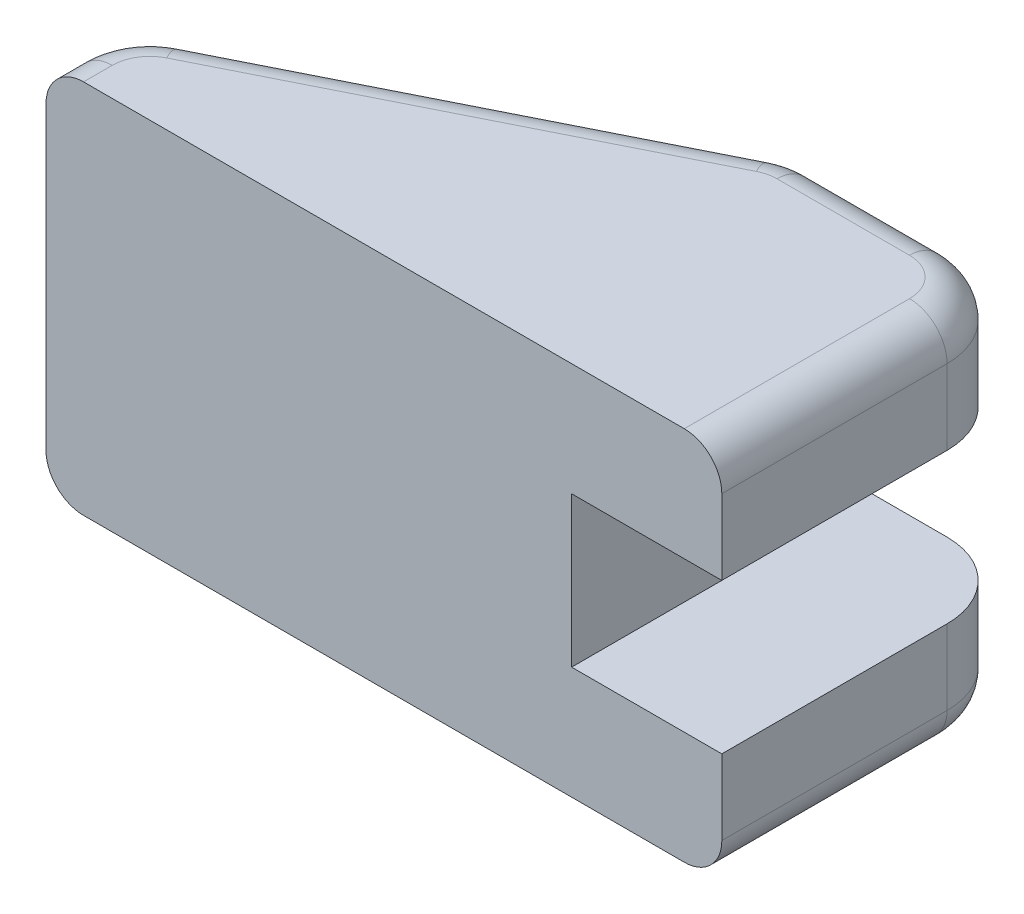
ISO-10303-21;
HEADER;
FILE_DESCRIPTION(('STEP AP214'),'2;1');
FILE_NAME('part.step','',(''),(''),'','','');
FILE_SCHEMA(('AUTOMOTIVE_DESIGN { 1 0 10303 214 1 1 1 1 }'));
ENDSEC;
DATA;
#1=APPLICATION_CONTEXT('core data for automotive mechanical design processes');
#2=APPLICATION_PROTOCOL_DEFINITION('international standard','automotive_design',2000,#1);
#3=PRODUCT_CONTEXT('',#1,'mechanical');
#4=PRODUCT('Part','Part','',(#3));
#5=PRODUCT_RELATED_PRODUCT_CATEGORY('part','',(#4));
#6=PRODUCT_DEFINITION_FORMATION('','',#4);
#7=PRODUCT_DEFINITION_CONTEXT('part definition',#1,'design');
#8=PRODUCT_DEFINITION('design','',#6,#7);
#9=PRODUCT_DEFINITION_SHAPE('','',#8);
#10=(LENGTH_UNIT() NAMED_UNIT(*) SI_UNIT(.MILLI.,.METRE.));
#11=(NAMED_UNIT(*) PLANE_ANGLE_UNIT() SI_UNIT($,.RADIAN.));
#12=(NAMED_UNIT(*) SI_UNIT($,.STERADIAN.) SOLID_ANGLE_UNIT());
#13=UNCERTAINTY_MEASURE_WITH_UNIT(LENGTH_MEASURE(1.E-05),#10,'distance_accuracy_value','');
#14=(GEOMETRIC_REPRESENTATION_CONTEXT(3) GLOBAL_UNCERTAINTY_ASSIGNED_CONTEXT((#13)) GLOBAL_UNIT_ASSIGNED_CONTEXT((#10,
#11,#12)) REPRESENTATION_CONTEXT('',''));
#15=CARTESIAN_POINT('',(0.,0.,0.));
#16=DIRECTION('',(0.,0.,1.));
#17=DIRECTION('',(1.,0.,0.));
#18=AXIS2_PLACEMENT_3D('',#15,#16,#17);
#19=CARTESIAN_POINT('',(-652.,0.,-40.));
#20=DIRECTION('',(-1.,0.,0.));
#21=DIRECTION('',(0.,0.,1.));
#22=AXIS2_PLACEMENT_3D('',#19,#20,#21);
#23=PLANE('',#22);
#24=DIRECTION('',(0.,-1.,0.));
#25=VECTOR('',#24,1.);
#26=CARTESIAN_POINT('',(-652.,0.,-3.81966011250102));
#27=LINE('',#26,#25);
#28=CARTESIAN_POINT('',(-652.,420.,-3.81966011250102));
#29=VERTEX_POINT('',#28);
#30=CARTESIAN_POINT('',(-652.,380.,-3.81966011250102));
#31=VERTEX_POINT('',#30);
#32=EDGE_CURVE('E253',#29,#31,#27,.T.);
#33=ORIENTED_EDGE('',*,*,#32,.T.);
#34=DIRECTION('',(0.,0.,1.));
#35=VECTOR('',#34,1.);
#36=CARTESIAN_POINT('',(-652.,380.,0.));
#37=LINE('',#36,#35);
#38=CARTESIAN_POINT('',(-652.,380.,0.));
#39=VERTEX_POINT('',#38);
#40=EDGE_CURVE('E269',#31,#39,#37,.T.);
#41=ORIENTED_EDGE('',*,*,#40,.T.);
#42=DIRECTION('',(0.,-1.,0.));
#43=VECTOR('',#42,1.);
#44=CARTESIAN_POINT('',(-652.,0.,0.));
#45=LINE('',#44,#43);
#46=CARTESIAN_POINT('',(-652.,420.,0.));
#47=VERTEX_POINT('',#46);
#48=EDGE_CURVE('E218',#47,#39,#45,.T.);
#49=ORIENTED_EDGE('',*,*,#48,.F.);
#50=DIRECTION('',(0.,0.,1.));
#51=VECTOR('',#50,1.);
#52=CARTESIAN_POINT('',(-652.,420.,-40.));
#53=LINE('',#52,#51);
#54=EDGE_CURVE('E267',#47,#29,#53,.F.);
#55=ORIENTED_EDGE('',*,*,#54,.T.);
#56=EDGE_LOOP('',(#33,#41,#49,#55));
#57=FACE_BOUND('',#56,.T.);
#58=ADVANCED_FACE('F44',(#57),#23,.T.);
#59=CARTESIAN_POINT('',(0.,425.,-40.));
#60=DIRECTION('',(0.,1.,0.));
#61=DIRECTION('',(0.,0.,1.));
#62=AXIS2_PLACEMENT_3D('',#59,#60,#61);
#63=PLANE('',#62);
#64=DIRECTION('',(-1.,0.,0.));
#65=VECTOR('',#64,1.);
#66=CARTESIAN_POINT('',(0.,425.,0.));
#67=LINE('',#66,#65);
#68=CARTESIAN_POINT('',(-567.,425.,0.));
#69=VERTEX_POINT('',#68);
#70=CARTESIAN_POINT('',(-647.,425.,0.));
#71=VERTEX_POINT('',#70);
#72=EDGE_CURVE('E209',#69,#71,#67,.T.);
#73=ORIENTED_EDGE('',*,*,#72,.F.);
#74=DIRECTION('',(0.,0.,1.));
#75=VECTOR('',#74,1.);
#76=CARTESIAN_POINT('',(-567.,425.,-40.));
#77=LINE('',#76,#75);
#78=CARTESIAN_POINT('',(-567.,425.,-30.));
#79=VERTEX_POINT('',#78);
#80=EDGE_CURVE('E61',#69,#79,#77,.F.);
#81=ORIENTED_EDGE('',*,*,#80,.T.);
#82=CARTESIAN_POINT('',(-572.,425.,-30.));
#83=DIRECTION('',(0.,1.,0.));
#84=DIRECTION('',(0.,0.,1.));
#85=AXIS2_PLACEMENT_3D('',#82,#83,#84);
#86=CIRCLE('',#85,5.);
#87=CARTESIAN_POINT('',(-572.,425.,-35.));
#88=VERTEX_POINT('',#87);
#89=EDGE_CURVE('E65',#79,#88,#86,.T.);
#90=ORIENTED_EDGE('',*,*,#89,.T.);
#91=DIRECTION('',(-1.,0.,0.));
#92=VECTOR('',#91,1.);
#93=CARTESIAN_POINT('',(-589.639320225002,425.,-35.));
#94=LINE('',#93,#92);
#95=CARTESIAN_POINT('',(-589.639320225002,425.,-35.));
#96=VERTEX_POINT('',#95);
#97=EDGE_CURVE('E321',#88,#96,#94,.T.);
#98=ORIENTED_EDGE('',*,*,#97,.T.);
#99=CARTESIAN_POINT('',(-589.639320225002,425.,-30.));
#100=DIRECTION('',(0.,1.,0.));
#101=DIRECTION('',(0.,0.,1.));
#102=AXIS2_PLACEMENT_3D('',#99,#100,#101);
#103=CIRCLE('',#102,5.);
#104=CARTESIAN_POINT('',(-591.875388202502,425.,-34.4721359549996));
#105=VERTEX_POINT('',#104);
#106=EDGE_CURVE('E319',#96,#105,#103,.T.);
#107=ORIENTED_EDGE('',*,*,#106,.T.);
#108=DIRECTION('',(-0.894427190999917,0.,0.447213595499956));
#109=VECTOR('',#108,1.);
#110=CARTESIAN_POINT('',(-116.163932022499,425.,-272.327864045));
#111=LINE('',#110,#109);
#112=CARTESIAN_POINT('',(-644.2360679775,425.,-8.29179606750059));
#113=VERTEX_POINT('',#112);
#114=EDGE_CURVE('E313',#105,#113,#111,.T.);
#115=ORIENTED_EDGE('',*,*,#114,.T.);
#116=CARTESIAN_POINT('',(-642.,425.,-3.81966011250102));
#117=DIRECTION('',(0.,1.,0.));
#118=DIRECTION('',(0.,0.,1.));
#119=AXIS2_PLACEMENT_3D('',#116,#117,#118);
#120=CIRCLE('',#119,5.);
#121=CARTESIAN_POINT('',(-647.,425.,-3.81966011250102));
#122=VERTEX_POINT('',#121);
#123=EDGE_CURVE('E315',#113,#122,#120,.T.);
#124=ORIENTED_EDGE('',*,*,#123,.T.);
#125=DIRECTION('',(0.,0.,1.));
#126=VECTOR('',#125,1.);
#127=CARTESIAN_POINT('',(-647.,425.,-40.));
#128=LINE('',#127,#126);
#129=EDGE_CURVE('E317',#122,#71,#128,.T.);
#130=ORIENTED_EDGE('',*,*,#129,.T.);
#131=EDGE_LOOP('',(#73,#81,#90,#98,#107,#115,#124,#130));
#132=FACE_BOUND('',#131,.T.);
#133=ADVANCED_FACE('F372',(#132),#63,.T.);
#134=CARTESIAN_POINT('',(-562.,0.,-40.));
#135=DIRECTION('',(1.,0.,0.));
#136=DIRECTION('',(0.,0.,-1.));
#137=AXIS2_PLACEMENT_3D('',#134,#135,#136);
#138=PLANE('',#137);
#139=DIRECTION('',(0.,1.,0.));
#140=VECTOR('',#139,1.);
#141=CARTESIAN_POINT('',(-562.,425.,-30.));
#142=LINE('',#141,#140);
#143=CARTESIAN_POINT('',(-562.,410.,-30.));
#144=VERTEX_POINT('',#143);
#145=CARTESIAN_POINT('',(-562.,420.,-30.));
#146=VERTEX_POINT('',#145);
#147=EDGE_CURVE('E262',#144,#146,#142,.T.);
#148=ORIENTED_EDGE('',*,*,#147,.T.);
#149=DIRECTION('',(0.,0.,1.));
#150=VECTOR('',#149,1.);
#151=CARTESIAN_POINT('',(-562.,420.,-40.));
#152=LINE('',#151,#150);
#153=CARTESIAN_POINT('',(-562.,420.,0.));
#154=VERTEX_POINT('',#153);
#155=EDGE_CURVE('E310',#146,#154,#152,.T.);
#156=ORIENTED_EDGE('',*,*,#155,.T.);
#157=DIRECTION('',(0.,1.,0.));
#158=VECTOR('',#157,1.);
#159=CARTESIAN_POINT('',(-562.,0.,0.));
#160=LINE('',#159,#158);
#161=CARTESIAN_POINT('',(-562.,410.,0.));
#162=VERTEX_POINT('',#161);
#163=EDGE_CURVE('E234',#162,#154,#160,.T.);
#164=ORIENTED_EDGE('',*,*,#163,.F.);
#165=DIRECTION('',(0.,0.,1.));
#166=VECTOR('',#165,1.);
#167=CARTESIAN_POINT('',(-562.,410.,-40.));
#168=LINE('',#167,#166);
#169=EDGE_CURVE('E239',#144,#162,#168,.T.);
#170=ORIENTED_EDGE('',*,*,#169,.F.);
#171=EDGE_LOOP('',(#148,#156,#164,#170));
#172=FACE_BOUND('',#171,.T.);
#173=ADVANCED_FACE('F381',(#172),#138,.T.);
#174=CARTESIAN_POINT('',(0.,410.,-40.));
#175=DIRECTION('',(0.,-1.,0.));
#176=DIRECTION('',(0.,0.,-1.));
#177=AXIS2_PLACEMENT_3D('',#174,#175,#176);
#178=PLANE('',#177);
#179=DIRECTION('',(1.,0.,0.));
#180=VECTOR('',#179,1.);
#181=CARTESIAN_POINT('',(0.,410.,-40.));
#182=LINE('',#181,#180);
#183=CARTESIAN_POINT('',(-582.,410.,-40.));
#184=VERTEX_POINT('',#183);
#185=CARTESIAN_POINT('',(-572.,410.,-40.));
#186=VERTEX_POINT('',#185);
#187=EDGE_CURVE('E214',#184,#186,#182,.T.);
#188=ORIENTED_EDGE('',*,*,#187,.T.);
#189=CARTESIAN_POINT('',(-572.,410.,-30.));
#190=DIRECTION('',(0.,-1.,0.));
#191=DIRECTION('',(0.,0.,-1.));
#192=AXIS2_PLACEMENT_3D('',#189,#190,#191);
#193=CIRCLE('',#192,10.);
#194=EDGE_CURVE('E265',#186,#144,#193,.T.);
#195=ORIENTED_EDGE('',*,*,#194,.T.);
#196=ORIENTED_EDGE('',*,*,#169,.T.);
#197=DIRECTION('',(1.,0.,0.));
#198=VECTOR('',#197,1.);
#199=CARTESIAN_POINT('',(0.,410.,0.));
#200=LINE('',#199,#198);
#201=CARTESIAN_POINT('',(-582.,410.,0.));
#202=VERTEX_POINT('',#201);
#203=EDGE_CURVE('E231',#202,#162,#200,.T.);
#204=ORIENTED_EDGE('',*,*,#203,.F.);
#205=DIRECTION('',(0.,0.,1.));
#206=VECTOR('',#205,1.);
#207=CARTESIAN_POINT('',(-582.,410.,-40.));
#208=LINE('',#207,#206);
#209=EDGE_CURVE('E197',#184,#202,#208,.T.);
#210=ORIENTED_EDGE('',*,*,#209,.F.);
#211=EDGE_LOOP('',(#188,#195,#196,#204,#210));
#212=FACE_BOUND('',#211,.T.);
#213=ADVANCED_FACE('F601',(#212),#178,.T.);
#214=CARTESIAN_POINT('',(-582.,0.,-40.));
#215=DIRECTION('',(1.,0.,0.));
#216=DIRECTION('',(0.,0.,-1.));
#217=AXIS2_PLACEMENT_3D('',#214,#215,#216);
#218=PLANE('',#217);
#219=DIRECTION('',(0.,1.,0.));
#220=VECTOR('',#219,1.);
#221=CARTESIAN_POINT('',(-582.,0.,0.));
#222=LINE('',#221,#220);
#223=CARTESIAN_POINT('',(-582.,390.,0.));
#224=VERTEX_POINT('',#223);
#225=EDGE_CURVE('E193',#224,#202,#222,.T.);
#226=ORIENTED_EDGE('',*,*,#225,.F.);
#227=DIRECTION('',(0.,0.,1.));
#228=VECTOR('',#227,1.);
#229=CARTESIAN_POINT('',(-582.,390.,-40.));
#230=LINE('',#229,#228);
#231=CARTESIAN_POINT('',(-582.,390.,-40.));
#232=VERTEX_POINT('',#231);
#233=EDGE_CURVE('E187',#232,#224,#230,.T.);
#234=ORIENTED_EDGE('',*,*,#233,.F.);
#235=DIRECTION('',(0.,1.,0.));
#236=VECTOR('',#235,1.);
#237=CARTESIAN_POINT('',(-582.,0.,-40.));
#238=LINE('',#237,#236);
#239=EDGE_CURVE('E191',#232,#184,#238,.T.);
#240=ORIENTED_EDGE('',*,*,#239,.T.);
#241=ORIENTED_EDGE('',*,*,#209,.T.);
#242=EDGE_LOOP('',(#226,#234,#240,#241));
#243=FACE_BOUND('',#242,.T.);
#244=ADVANCED_FACE('F189',(#243),#218,.T.);
#245=CARTESIAN_POINT('',(0.,390.,-40.));
#246=DIRECTION('',(0.,-1.,0.));
#247=DIRECTION('',(0.,0.,-1.));
#248=AXIS2_PLACEMENT_3D('',#245,#246,#247);
#249=PLANE('',#248);
#250=DIRECTION('',(0.,0.,1.));
#251=VECTOR('',#250,1.);
#252=CARTESIAN_POINT('',(-562.,390.,-40.));
#253=LINE('',#252,#251);
#254=CARTESIAN_POINT('',(-562.,390.,-30.));
#255=VERTEX_POINT('',#254);
#256=CARTESIAN_POINT('',(-562.,390.,0.));
#257=VERTEX_POINT('',#256);
#258=EDGE_CURVE('E198',#255,#257,#253,.T.);
#259=ORIENTED_EDGE('',*,*,#258,.F.);
#260=CARTESIAN_POINT('',(-572.,390.,-30.));
#261=DIRECTION('',(0.,-1.,0.));
#262=DIRECTION('',(0.,0.,-1.));
#263=AXIS2_PLACEMENT_3D('',#260,#261,#262);
#264=CIRCLE('',#263,10.);
#265=CARTESIAN_POINT('',(-572.,390.,-40.));
#266=VERTEX_POINT('',#265);
#267=EDGE_CURVE('E205',#255,#266,#264,.F.);
#268=ORIENTED_EDGE('',*,*,#267,.T.);
#269=DIRECTION('',(1.,0.,0.));
#270=VECTOR('',#269,1.);
#271=CARTESIAN_POINT('',(0.,390.,-40.));
#272=LINE('',#271,#270);
#273=EDGE_CURVE('E201',#232,#266,#272,.T.);
#274=ORIENTED_EDGE('',*,*,#273,.F.);
#275=ORIENTED_EDGE('',*,*,#233,.T.);
#276=DIRECTION('',(1.,0.,0.));
#277=VECTOR('',#276,1.);
#278=CARTESIAN_POINT('',(0.,390.,0.));
#279=LINE('',#278,#277);
#280=EDGE_CURVE('E228',#224,#257,#279,.T.);
#281=ORIENTED_EDGE('',*,*,#280,.T.);
#282=EDGE_LOOP('',(#259,#268,#274,#275,#281));
#283=FACE_BOUND('',#282,.T.);
#284=ADVANCED_FACE('F203',(#283),#249,.F.);
#285=CARTESIAN_POINT('',(-562.,0.,-40.));
#286=DIRECTION('',(-1.,0.,0.));
#287=DIRECTION('',(0.,0.,1.));
#288=AXIS2_PLACEMENT_3D('',#285,#286,#287);
#289=PLANE('',#288);
#290=DIRECTION('',(0.,-1.,0.));
#291=VECTOR('',#290,1.);
#292=CARTESIAN_POINT('',(-562.,0.,0.));
#293=LINE('',#292,#291);
#294=CARTESIAN_POINT('',(-562.,380.,0.));
#295=VERTEX_POINT('',#294);
#296=EDGE_CURVE('E225',#257,#295,#293,.T.);
#297=ORIENTED_EDGE('',*,*,#296,.T.);
#298=DIRECTION('',(0.,0.,1.));
#299=VECTOR('',#298,1.);
#300=CARTESIAN_POINT('',(-562.,380.,-40.));
#301=LINE('',#300,#299);
#302=CARTESIAN_POINT('',(-562.,380.,-30.));
#303=VERTEX_POINT('',#302);
#304=EDGE_CURVE('E298',#295,#303,#301,.F.);
#305=ORIENTED_EDGE('',*,*,#304,.T.);
#306=DIRECTION('',(0.,-1.,0.));
#307=VECTOR('',#306,1.);
#308=CARTESIAN_POINT('',(-562.,0.,-30.));
#309=LINE('',#308,#307);
#310=EDGE_CURVE('E250',#303,#255,#309,.F.);
#311=ORIENTED_EDGE('',*,*,#310,.T.);
#312=ORIENTED_EDGE('',*,*,#258,.T.);
#313=EDGE_LOOP('',(#297,#305,#311,#312));
#314=FACE_BOUND('',#313,.T.);
#315=ADVANCED_FACE('F586',(#314),#289,.F.);
#316=CARTESIAN_POINT('',(0.,375.,-40.));
#317=DIRECTION('',(0.,1.,0.));
#318=DIRECTION('',(0.,0.,1.));
#319=AXIS2_PLACEMENT_3D('',#316,#317,#318);
#320=PLANE('',#319);
#321=DIRECTION('',(-1.,0.,0.));
#322=VECTOR('',#321,1.);
#323=CARTESIAN_POINT('',(0.,375.,0.));
#324=LINE('',#323,#322);
#325=CARTESIAN_POINT('',(-567.,375.,0.));
#326=VERTEX_POINT('',#325);
#327=CARTESIAN_POINT('',(-647.,375.,0.));
#328=VERTEX_POINT('',#327);
#329=EDGE_CURVE('E221',#326,#328,#324,.T.);
#330=ORIENTED_EDGE('',*,*,#329,.T.);
#331=DIRECTION('',(0.,0.,1.));
#332=VECTOR('',#331,1.);
#333=CARTESIAN_POINT('',(-647.,375.,-3.81966011250102));
#334=LINE('',#333,#332);
#335=CARTESIAN_POINT('',(-647.,375.,-3.81966011250102));
#336=VERTEX_POINT('',#335);
#337=EDGE_CURVE('E292',#328,#336,#334,.F.);
#338=ORIENTED_EDGE('',*,*,#337,.T.);
#339=CARTESIAN_POINT('',(-642.,375.,-3.81966011250102));
#340=DIRECTION('',(0.,1.,0.));
#341=DIRECTION('',(0.,0.,1.));
#342=AXIS2_PLACEMENT_3D('',#339,#340,#341);
#343=CIRCLE('',#342,5.);
#344=CARTESIAN_POINT('',(-644.2360679775,375.,-8.2917960675006));
#345=VERTEX_POINT('',#344);
#346=EDGE_CURVE('E290',#336,#345,#343,.F.);
#347=ORIENTED_EDGE('',*,*,#346,.T.);
#348=DIRECTION('',(0.894427190999917,0.,-0.447213595499956));
#349=VECTOR('',#348,1.);
#350=CARTESIAN_POINT('',(-591.875388202502,375.,-34.4721359549995));
#351=LINE('',#350,#349);
#352=CARTESIAN_POINT('',(-591.875388202502,375.,-34.4721359549996));
#353=VERTEX_POINT('',#352);
#354=EDGE_CURVE('E280',#345,#353,#351,.T.);
#355=ORIENTED_EDGE('',*,*,#354,.T.);
#356=CARTESIAN_POINT('',(-589.639320225002,375.,-30.));
#357=DIRECTION('',(0.,1.,0.));
#358=DIRECTION('',(0.,0.,1.));
#359=AXIS2_PLACEMENT_3D('',#356,#357,#358);
#360=CIRCLE('',#359,5.);
#361=CARTESIAN_POINT('',(-589.639320225002,375.,-35.));
#362=VERTEX_POINT('',#361);
#363=EDGE_CURVE('E282',#353,#362,#360,.F.);
#364=ORIENTED_EDGE('',*,*,#363,.T.);
#365=DIRECTION('',(-1.,0.,0.));
#366=VECTOR('',#365,1.);
#367=CARTESIAN_POINT('',(0.,375.,-35.));
#368=LINE('',#367,#366);
#369=CARTESIAN_POINT('',(-572.,375.,-35.));
#370=VERTEX_POINT('',#369);
#371=EDGE_CURVE('E284',#362,#370,#368,.F.);
#372=ORIENTED_EDGE('',*,*,#371,.T.);
#373=CARTESIAN_POINT('',(-572.,375.,-30.));
#374=DIRECTION('',(0.,1.,0.));
#375=DIRECTION('',(0.,0.,1.));
#376=AXIS2_PLACEMENT_3D('',#373,#374,#375);
#377=CIRCLE('',#376,5.);
#378=CARTESIAN_POINT('',(-567.,375.,-30.));
#379=VERTEX_POINT('',#378);
#380=EDGE_CURVE('E286',#370,#379,#377,.F.);
#381=ORIENTED_EDGE('',*,*,#380,.T.);
#382=DIRECTION('',(0.,0.,1.));
#383=VECTOR('',#382,1.);
#384=CARTESIAN_POINT('',(-567.,375.,-40.));
#385=LINE('',#384,#383);
#386=EDGE_CURVE('E288',#379,#326,#385,.T.);
#387=ORIENTED_EDGE('',*,*,#386,.T.);
#388=EDGE_LOOP('',(#330,#338,#347,#355,#364,#372,#381,#387));
#389=FACE_BOUND('',#388,.T.);
#390=ADVANCED_FACE('F435',(#389),#320,.F.);
#391=CARTESIAN_POINT('',(0.,0.,-40.));
#392=DIRECTION('',(0.,0.,1.));
#393=DIRECTION('',(1.,0.,0.));
#394=AXIS2_PLACEMENT_3D('',#391,#392,#393);
#395=PLANE('',#394);
#396=DIRECTION('',(0.,-1.,0.));
#397=VECTOR('',#396,1.);
#398=CARTESIAN_POINT('',(-572.,0.,-40.));
#399=LINE('',#398,#397);
#400=CARTESIAN_POINT('',(-572.,380.,-40.));
#401=VERTEX_POINT('',#400);
#402=EDGE_CURVE('E248',#266,#401,#399,.T.);
#403=ORIENTED_EDGE('',*,*,#402,.T.);
#404=DIRECTION('',(-1.,0.,0.));
#405=VECTOR('',#404,1.);
#406=CARTESIAN_POINT('',(0.,380.,-40.));
#407=LINE('',#406,#405);
#408=CARTESIAN_POINT('',(-589.639320225002,380.,-40.));
#409=VERTEX_POINT('',#408);
#410=EDGE_CURVE('E304',#401,#409,#407,.T.);
#411=ORIENTED_EDGE('',*,*,#410,.T.);
#412=DIRECTION('',(0.,1.,0.));
#413=VECTOR('',#412,1.);
#414=CARTESIAN_POINT('',(-589.639320225002,425.,-40.));
#415=LINE('',#414,#413);
#416=CARTESIAN_POINT('',(-589.639320225002,420.,-40.));
#417=VERTEX_POINT('',#416);
#418=EDGE_CURVE('E245',#409,#417,#415,.T.);
#419=ORIENTED_EDGE('',*,*,#418,.T.);
#420=DIRECTION('',(-1.,0.,0.));
#421=VECTOR('',#420,1.);
#422=CARTESIAN_POINT('',(-572.,420.,-40.));
#423=LINE('',#422,#421);
#424=CARTESIAN_POINT('',(-572.,420.,-40.));
#425=VERTEX_POINT('',#424);
#426=EDGE_CURVE('E302',#417,#425,#423,.F.);
#427=ORIENTED_EDGE('',*,*,#426,.T.);
#428=DIRECTION('',(0.,1.,0.));
#429=VECTOR('',#428,1.);
#430=CARTESIAN_POINT('',(-572.,410.,-40.));
#431=LINE('',#430,#429);
#432=EDGE_CURVE('E241',#425,#186,#431,.F.);
#433=ORIENTED_EDGE('',*,*,#432,.T.);
#434=ORIENTED_EDGE('',*,*,#187,.F.);
#435=ORIENTED_EDGE('',*,*,#239,.F.);
#436=ORIENTED_EDGE('',*,*,#273,.T.);
#437=EDGE_LOOP('',(#403,#411,#419,#427,#433,#434,#435,#436));
#438=FACE_BOUND('',#437,.T.);
#439=ADVANCED_FACE('F212',(#438),#395,.F.);
#440=CARTESIAN_POINT('',(0.,0.,0.));
#441=DIRECTION('',(0.,0.,1.));
#442=DIRECTION('',(1.,0.,0.));
#443=AXIS2_PLACEMENT_3D('',#440,#441,#442);
#444=PLANE('',#443);
#445=ORIENTED_EDGE('',*,*,#48,.T.);
#446=CARTESIAN_POINT('',(-647.,380.,0.));
#447=DIRECTION('',(0.,0.,1.));
#448=DIRECTION('',(1.,0.,0.));
#449=AXIS2_PLACEMENT_3D('',#446,#447,#448);
#450=CIRCLE('',#449,5.);
#451=EDGE_CURVE('E278',#39,#328,#450,.T.);
#452=ORIENTED_EDGE('',*,*,#451,.T.);
#453=ORIENTED_EDGE('',*,*,#329,.F.);
#454=CARTESIAN_POINT('',(-567.,380.,0.));
#455=DIRECTION('',(0.,0.,1.));
#456=DIRECTION('',(1.,0.,0.));
#457=AXIS2_PLACEMENT_3D('',#454,#455,#456);
#458=CIRCLE('',#457,5.);
#459=EDGE_CURVE('E276',#326,#295,#458,.T.);
#460=ORIENTED_EDGE('',*,*,#459,.T.);
#461=ORIENTED_EDGE('',*,*,#296,.F.);
#462=ORIENTED_EDGE('',*,*,#280,.F.);
#463=ORIENTED_EDGE('',*,*,#225,.T.);
#464=ORIENTED_EDGE('',*,*,#203,.T.);
#465=ORIENTED_EDGE('',*,*,#163,.T.);
#466=CARTESIAN_POINT('',(-567.,420.,0.));
#467=DIRECTION('',(0.,0.,1.));
#468=DIRECTION('',(1.,0.,0.));
#469=AXIS2_PLACEMENT_3D('',#466,#467,#468);
#470=CIRCLE('',#469,5.);
#471=EDGE_CURVE('E274',#154,#69,#470,.T.);
#472=ORIENTED_EDGE('',*,*,#471,.T.);
#473=ORIENTED_EDGE('',*,*,#72,.T.);
#474=CARTESIAN_POINT('',(-647.,420.,0.));
#475=DIRECTION('',(0.,0.,1.));
#476=DIRECTION('',(1.,0.,0.));
#477=AXIS2_PLACEMENT_3D('',#474,#475,#476);
#478=CIRCLE('',#477,5.);
#479=EDGE_CURVE('E272',#71,#47,#478,.T.);
#480=ORIENTED_EDGE('',*,*,#479,.T.);
#481=EDGE_LOOP('',(#445,#452,#453,#460,#461,#462,#463,#464,#465,#472,#473,#480));
#482=FACE_BOUND('',#481,.T.);
#483=ADVANCED_FACE('F374',(#482),#444,.T.);
#484=CARTESIAN_POINT('',(-652.,0.,-9.99999999999995));
#485=DIRECTION('',(-0.447213595499956,0.,-0.894427190999917));
#486=DIRECTION('',(0.,1.,0.));
#487=AXIS2_PLACEMENT_3D('',#484,#485,#486);
#488=PLANE('',#487);
#489=DIRECTION('',(0.,1.,0.));
#490=VECTOR('',#489,1.);
#491=CARTESIAN_POINT('',(-594.111456180001,375.,-38.9442719099992));
#492=LINE('',#491,#490);
#493=CARTESIAN_POINT('',(-594.111456180001,420.,-38.9442719099992));
#494=VERTEX_POINT('',#493);
#495=CARTESIAN_POINT('',(-594.111456180001,380.,-38.9442719099992));
#496=VERTEX_POINT('',#495);
#497=EDGE_CURVE('E256',#494,#496,#492,.F.);
#498=ORIENTED_EDGE('',*,*,#497,.T.);
#499=DIRECTION('',(0.894427190999917,0.,-0.447213595499956));
#500=VECTOR('',#499,1.);
#501=CARTESIAN_POINT('',(-646.472135955,380.,-12.7639320225001));
#502=LINE('',#501,#500);
#503=CARTESIAN_POINT('',(-646.472135955,380.,-12.7639320225002));
#504=VERTEX_POINT('',#503);
#505=EDGE_CURVE('E11',#496,#504,#502,.F.);
#506=ORIENTED_EDGE('',*,*,#505,.T.);
#507=DIRECTION('',(0.,-1.,0.));
#508=VECTOR('',#507,1.);
#509=CARTESIAN_POINT('',(-646.472135955,0.,-12.7639320225002));
#510=LINE('',#509,#508);
#511=CARTESIAN_POINT('',(-646.472135955,420.,-12.7639320225002));
#512=VERTEX_POINT('',#511);
#513=EDGE_CURVE('E259',#504,#512,#510,.F.);
#514=ORIENTED_EDGE('',*,*,#513,.T.);
#515=DIRECTION('',(-0.894427190999917,0.,0.447213595499956));
#516=VECTOR('',#515,1.);
#517=CARTESIAN_POINT('',(-652.,420.,-9.99999999999995));
#518=LINE('',#517,#516);
#519=EDGE_CURVE('E53',#512,#494,#518,.F.);
#520=ORIENTED_EDGE('',*,*,#519,.T.);
#521=EDGE_LOOP('',(#498,#506,#514,#520));
#522=FACE_BOUND('',#521,.T.);
#523=ADVANCED_FACE('F403',(#522),#488,.T.);
#524=CARTESIAN_POINT('',(-572.,0.,-30.));
#525=DIRECTION('',(0.,-1.,0.));
#526=DIRECTION('',(0.,0.,-1.));
#527=AXIS2_PLACEMENT_3D('',#524,#525,#526);
#528=CYLINDRICAL_SURFACE('',#527,10.);
#529=ORIENTED_EDGE('',*,*,#310,.F.);
#530=CARTESIAN_POINT('',(-572.,380.,-30.));
#531=DIRECTION('',(0.,1.,0.));
#532=DIRECTION('',(0.,0.,1.));
#533=AXIS2_PLACEMENT_3D('',#530,#531,#532);
#534=CIRCLE('',#533,10.);
#535=EDGE_CURVE('E300',#303,#401,#534,.T.);
#536=ORIENTED_EDGE('',*,*,#535,.T.);
#537=ORIENTED_EDGE('',*,*,#402,.F.);
#538=ORIENTED_EDGE('',*,*,#267,.F.);
#539=EDGE_LOOP('',(#529,#536,#537,#538));
#540=FACE_BOUND('',#539,.T.);
#541=ADVANCED_FACE('F449',(#540),#528,.T.);
#542=CARTESIAN_POINT('',(-642.,0.,-3.81966011250102));
#543=DIRECTION('',(0.,-1.,0.));
#544=DIRECTION('',(0.,0.,-1.));
#545=AXIS2_PLACEMENT_3D('',#542,#543,#544);
#546=CYLINDRICAL_SURFACE('',#545,10.);
#547=ORIENTED_EDGE('',*,*,#513,.F.);
#548=CARTESIAN_POINT('',(-642.,380.,-3.81966011250102));
#549=DIRECTION('',(0.,1.,0.));
#550=DIRECTION('',(0.,0.,1.));
#551=AXIS2_PLACEMENT_3D('',#548,#549,#550);
#552=CIRCLE('',#551,10.);
#553=EDGE_CURVE('E296',#504,#31,#552,.T.);
#554=ORIENTED_EDGE('',*,*,#553,.T.);
#555=ORIENTED_EDGE('',*,*,#32,.F.);
#556=CARTESIAN_POINT('',(-642.,420.,-3.81966011250102));
#557=DIRECTION('',(0.,1.,0.));
#558=DIRECTION('',(0.,0.,1.));
#559=AXIS2_PLACEMENT_3D('',#556,#557,#558);
#560=CIRCLE('',#559,10.);
#561=EDGE_CURVE('E294',#29,#512,#560,.F.);
#562=ORIENTED_EDGE('',*,*,#561,.T.);
#563=EDGE_LOOP('',(#547,#554,#555,#562));
#564=FACE_BOUND('',#563,.T.);
#565=ADVANCED_FACE('F421',(#564),#546,.T.);
#566=CARTESIAN_POINT('',(-589.639320225002,0.,-30.));
#567=DIRECTION('',(0.,-1.,0.));
#568=DIRECTION('',(0.,0.,-1.));
#569=AXIS2_PLACEMENT_3D('',#566,#567,#568);
#570=CYLINDRICAL_SURFACE('',#569,10.);
#571=ORIENTED_EDGE('',*,*,#418,.F.);
#572=CARTESIAN_POINT('',(-589.639320225002,380.,-30.));
#573=DIRECTION('',(0.,1.,0.));
#574=DIRECTION('',(0.,0.,1.));
#575=AXIS2_PLACEMENT_3D('',#572,#573,#574);
#576=CIRCLE('',#575,10.);
#577=EDGE_CURVE('E308',#409,#496,#576,.T.);
#578=ORIENTED_EDGE('',*,*,#577,.T.);
#579=ORIENTED_EDGE('',*,*,#497,.F.);
#580=CARTESIAN_POINT('',(-589.639320225002,420.,-30.));
#581=DIRECTION('',(0.,1.,0.));
#582=DIRECTION('',(0.,0.,1.));
#583=AXIS2_PLACEMENT_3D('',#580,#581,#582);
#584=CIRCLE('',#583,10.);
#585=EDGE_CURVE('E306',#494,#417,#584,.F.);
#586=ORIENTED_EDGE('',*,*,#585,.T.);
#587=EDGE_LOOP('',(#571,#578,#579,#586));
#588=FACE_BOUND('',#587,.T.);
#589=ADVANCED_FACE('F408',(#588),#570,.T.);
#590=CARTESIAN_POINT('',(-572.,0.,-30.));
#591=DIRECTION('',(0.,-1.,0.));
#592=DIRECTION('',(0.,0.,-1.));
#593=AXIS2_PLACEMENT_3D('',#590,#591,#592);
#594=CYLINDRICAL_SURFACE('',#593,10.);
#595=ORIENTED_EDGE('',*,*,#432,.F.);
#596=CARTESIAN_POINT('',(-572.,420.,-30.));
#597=DIRECTION('',(0.,1.,0.));
#598=DIRECTION('',(0.,0.,1.));
#599=AXIS2_PLACEMENT_3D('',#596,#597,#598);
#600=CIRCLE('',#599,10.);
#601=EDGE_CURVE('E325',#425,#146,#600,.F.);
#602=ORIENTED_EDGE('',*,*,#601,.T.);
#603=ORIENTED_EDGE('',*,*,#147,.F.);
#604=ORIENTED_EDGE('',*,*,#194,.F.);
#605=EDGE_LOOP('',(#595,#602,#603,#604));
#606=FACE_BOUND('',#605,.T.);
#607=ADVANCED_FACE('F481',(#606),#594,.T.);
#608=CARTESIAN_POINT('',(-567.,380.,-40.));
#609=DIRECTION('',(0.,0.,1.));
#610=DIRECTION('',(1.,0.,0.));
#611=AXIS2_PLACEMENT_3D('',#608,#609,#610);
#612=CYLINDRICAL_SURFACE('',#611,5.);
#613=ORIENTED_EDGE('',*,*,#459,.F.);
#614=ORIENTED_EDGE('',*,*,#386,.F.);
#615=CARTESIAN_POINT('',(-567.,380.,-30.));
#616=DIRECTION('',(0.,0.,-1.));
#617=DIRECTION('',(-1.,0.,0.));
#618=AXIS2_PLACEMENT_3D('',#615,#616,#617);
#619=CIRCLE('',#618,5.);
#620=EDGE_CURVE('E222',#303,#379,#619,.T.);
#621=ORIENTED_EDGE('',*,*,#620,.F.);
#622=ORIENTED_EDGE('',*,*,#304,.F.);
#623=EDGE_LOOP('',(#613,#614,#621,#622));
#624=FACE_BOUND('',#623,.T.);
#625=ADVANCED_FACE('F440',(#624),#612,.T.);
#626=CARTESIAN_POINT('',(-572.,380.,-30.));
#627=DIRECTION('',(0.,1.,0.));
#628=DIRECTION('',(0.,0.,1.));
#629=AXIS2_PLACEMENT_3D('',#626,#627,#628);
#630=DEGENERATE_TOROIDAL_SURFACE('',#629,5.,5.,.T.);
#631=ORIENTED_EDGE('',*,*,#620,.T.);
#632=ORIENTED_EDGE('',*,*,#380,.F.);
#633=CARTESIAN_POINT('',(-572.,380.,-35.));
#634=DIRECTION('',(-1.,0.,0.));
#635=DIRECTION('',(0.,0.,1.));
#636=AXIS2_PLACEMENT_3D('',#633,#634,#635);
#637=CIRCLE('',#636,5.);
#638=EDGE_CURVE('E340',#401,#370,#637,.T.);
#639=ORIENTED_EDGE('',*,*,#638,.F.);
#640=ORIENTED_EDGE('',*,*,#535,.F.);
#641=EDGE_LOOP('',(#631,#632,#639,#640));
#642=FACE_BOUND('',#641,.T.);
#643=ADVANCED_FACE('F444',(#642),#630,.T.);
#644=CARTESIAN_POINT('',(0.,380.,-35.));
#645=DIRECTION('',(-1.,0.,0.));
#646=DIRECTION('',(0.,0.,1.));
#647=AXIS2_PLACEMENT_3D('',#644,#645,#646);
#648=CYLINDRICAL_SURFACE('',#647,5.);
#649=ORIENTED_EDGE('',*,*,#638,.T.);
#650=ORIENTED_EDGE('',*,*,#371,.F.);
#651=CARTESIAN_POINT('',(-589.639320225002,380.,-35.));
#652=DIRECTION('',(-1.,0.,0.));
#653=DIRECTION('',(0.,0.,1.));
#654=AXIS2_PLACEMENT_3D('',#651,#652,#653);
#655=CIRCLE('',#654,5.);
#656=EDGE_CURVE('E337',#409,#362,#655,.T.);
#657=ORIENTED_EDGE('',*,*,#656,.F.);
#658=ORIENTED_EDGE('',*,*,#410,.F.);
#659=EDGE_LOOP('',(#649,#650,#657,#658));
#660=FACE_BOUND('',#659,.T.);
#661=ADVANCED_FACE('F451',(#660),#648,.T.);
#662=CARTESIAN_POINT('',(-589.639320225002,380.,-30.));
#663=DIRECTION('',(0.,1.,0.));
#664=DIRECTION('',(0.,0.,1.));
#665=AXIS2_PLACEMENT_3D('',#662,#663,#664);
#666=DEGENERATE_TOROIDAL_SURFACE('',#665,5.,5.,.T.);
#667=ORIENTED_EDGE('',*,*,#656,.T.);
#668=ORIENTED_EDGE('',*,*,#363,.F.);
#669=CARTESIAN_POINT('',(-591.875388202502,380.,-34.4721359549996));
#670=DIRECTION('',(-0.894427190999919,0.,0.447213595499951));
#671=DIRECTION('',(0.447213595499951,0.,0.894427190999919));
#672=AXIS2_PLACEMENT_3D('',#669,#670,#671);
#673=CIRCLE('',#672,5.);
#674=EDGE_CURVE('E334',#496,#353,#673,.T.);
#675=ORIENTED_EDGE('',*,*,#674,.F.);
#676=ORIENTED_EDGE('',*,*,#577,.F.);
#677=EDGE_LOOP('',(#667,#668,#675,#676));
#678=FACE_BOUND('',#677,.T.);
#679=ADVANCED_FACE('F412',(#678),#666,.T.);
#680=CARTESIAN_POINT('',(-116.163932022499,380.,-272.327864045));
#681=DIRECTION('',(-0.894427190999917,0.,0.447213595499956));
#682=DIRECTION('',(0.447213595499956,0.,0.894427190999917));
#683=AXIS2_PLACEMENT_3D('',#680,#681,#682);
#684=CYLINDRICAL_SURFACE('',#683,5.);
#685=ORIENTED_EDGE('',*,*,#674,.T.);
#686=ORIENTED_EDGE('',*,*,#354,.F.);
#687=CARTESIAN_POINT('',(-644.2360679775,380.,-8.29179606750061));
#688=DIRECTION('',(-0.894427190999919,0.,0.447213595499952));
#689=DIRECTION('',(0.447213595499952,0.,0.894427190999919));
#690=AXIS2_PLACEMENT_3D('',#687,#688,#689);
#691=CIRCLE('',#690,5.);
#692=EDGE_CURVE('E331',#504,#345,#691,.T.);
#693=ORIENTED_EDGE('',*,*,#692,.F.);
#694=ORIENTED_EDGE('',*,*,#505,.F.);
#695=EDGE_LOOP('',(#685,#686,#693,#694));
#696=FACE_BOUND('',#695,.T.);
#697=ADVANCED_FACE('F418',(#696),#684,.T.);
#698=CARTESIAN_POINT('',(-642.,380.,-3.81966011250102));
#699=DIRECTION('',(0.,1.,0.));
#700=DIRECTION('',(0.,0.,1.));
#701=AXIS2_PLACEMENT_3D('',#698,#699,#700);
#702=DEGENERATE_TOROIDAL_SURFACE('',#701,5.,5.,.T.);
#703=ORIENTED_EDGE('',*,*,#692,.T.);
#704=ORIENTED_EDGE('',*,*,#346,.F.);
#705=CARTESIAN_POINT('',(-647.,380.,-3.81966011250102));
#706=DIRECTION('',(0.,0.,1.));
#707=DIRECTION('',(1.,0.,0.));
#708=AXIS2_PLACEMENT_3D('',#705,#706,#707);
#709=CIRCLE('',#708,5.);
#710=EDGE_CURVE('E328',#31,#336,#709,.T.);
#711=ORIENTED_EDGE('',*,*,#710,.F.);
#712=ORIENTED_EDGE('',*,*,#553,.F.);
#713=EDGE_LOOP('',(#703,#704,#711,#712));
#714=FACE_BOUND('',#713,.T.);
#715=ADVANCED_FACE('F428',(#714),#702,.T.);
#716=CARTESIAN_POINT('',(-647.,380.,-40.));
#717=DIRECTION('',(0.,0.,-1.));
#718=DIRECTION('',(-1.,0.,0.));
#719=AXIS2_PLACEMENT_3D('',#716,#717,#718);
#720=CYLINDRICAL_SURFACE('',#719,5.);
#721=ORIENTED_EDGE('',*,*,#710,.T.);
#722=ORIENTED_EDGE('',*,*,#337,.F.);
#723=ORIENTED_EDGE('',*,*,#451,.F.);
#724=ORIENTED_EDGE('',*,*,#40,.F.);
#725=EDGE_LOOP('',(#721,#722,#723,#724));
#726=FACE_BOUND('',#725,.T.);
#727=ADVANCED_FACE('F431',(#726),#720,.T.);
#728=CARTESIAN_POINT('',(-647.,420.,-40.));
#729=DIRECTION('',(0.,0.,1.));
#730=DIRECTION('',(1.,0.,0.));
#731=AXIS2_PLACEMENT_3D('',#728,#729,#730);
#732=CYLINDRICAL_SURFACE('',#731,5.);
#733=ORIENTED_EDGE('',*,*,#479,.F.);
#734=ORIENTED_EDGE('',*,*,#129,.F.);
#735=CARTESIAN_POINT('',(-647.,420.,-3.81966011250102));
#736=DIRECTION('',(0.,0.,-1.));
#737=DIRECTION('',(-1.,0.,0.));
#738=AXIS2_PLACEMENT_3D('',#735,#736,#737);
#739=CIRCLE('',#738,5.);
#740=EDGE_CURVE('E48',#29,#122,#739,.T.);
#741=ORIENTED_EDGE('',*,*,#740,.F.);
#742=ORIENTED_EDGE('',*,*,#54,.F.);
#743=EDGE_LOOP('',(#733,#734,#741,#742));
#744=FACE_BOUND('',#743,.T.);
#745=ADVANCED_FACE('F46',(#744),#732,.T.);
#746=CARTESIAN_POINT('',(-642.,420.,-3.81966011250102));
#747=DIRECTION('',(0.,1.,0.));
#748=DIRECTION('',(0.,0.,1.));
#749=AXIS2_PLACEMENT_3D('',#746,#747,#748);
#750=DEGENERATE_TOROIDAL_SURFACE('',#749,5.,5.,.T.);
#751=ORIENTED_EDGE('',*,*,#740,.T.);
#752=ORIENTED_EDGE('',*,*,#123,.F.);
#753=CARTESIAN_POINT('',(-644.2360679775,420.,-8.29179606750061));
#754=DIRECTION('',(0.894427190999919,0.,-0.447213595499951));
#755=DIRECTION('',(-0.447213595499951,0.,-0.894427190999919));
#756=AXIS2_PLACEMENT_3D('',#753,#754,#755);
#757=CIRCLE('',#756,5.);
#758=EDGE_CURVE('E356',#512,#113,#757,.T.);
#759=ORIENTED_EDGE('',*,*,#758,.F.);
#760=ORIENTED_EDGE('',*,*,#561,.F.);
#761=EDGE_LOOP('',(#751,#752,#759,#760));
#762=FACE_BOUND('',#761,.T.);
#763=ADVANCED_FACE('F367',(#762),#750,.T.);
#764=CARTESIAN_POINT('',(-116.163932022499,420.,-272.327864045));
#765=DIRECTION('',(-0.894427190999917,0.,0.447213595499956));
#766=DIRECTION('',(0.447213595499956,0.,0.894427190999917));
#767=AXIS2_PLACEMENT_3D('',#764,#765,#766);
#768=CYLINDRICAL_SURFACE('',#767,5.);
#769=ORIENTED_EDGE('',*,*,#758,.T.);
#770=ORIENTED_EDGE('',*,*,#114,.F.);
#771=CARTESIAN_POINT('',(-591.875388202502,420.,-34.4721359549996));
#772=DIRECTION('',(0.894427190999919,0.,-0.447213595499952));
#773=DIRECTION('',(-0.447213595499952,0.,-0.894427190999919));
#774=AXIS2_PLACEMENT_3D('',#771,#772,#773);
#775=CIRCLE('',#774,5.);
#776=EDGE_CURVE('E354',#494,#105,#775,.T.);
#777=ORIENTED_EDGE('',*,*,#776,.F.);
#778=ORIENTED_EDGE('',*,*,#519,.F.);
#779=EDGE_LOOP('',(#769,#770,#777,#778));
#780=FACE_BOUND('',#779,.T.);
#781=ADVANCED_FACE('F400',(#780),#768,.T.);
#782=CARTESIAN_POINT('',(-589.639320225002,420.,-30.));
#783=DIRECTION('',(0.,1.,0.));
#784=DIRECTION('',(0.,0.,1.));
#785=AXIS2_PLACEMENT_3D('',#782,#783,#784);
#786=DEGENERATE_TOROIDAL_SURFACE('',#785,5.,5.,.T.);
#787=ORIENTED_EDGE('',*,*,#776,.T.);
#788=ORIENTED_EDGE('',*,*,#106,.F.);
#789=CARTESIAN_POINT('',(-589.639320225002,420.,-35.));
#790=DIRECTION('',(1.,0.,0.));
#791=DIRECTION('',(0.,0.,-1.));
#792=AXIS2_PLACEMENT_3D('',#789,#790,#791);
#793=CIRCLE('',#792,5.);
#794=EDGE_CURVE('E351',#417,#96,#793,.T.);
#795=ORIENTED_EDGE('',*,*,#794,.F.);
#796=ORIENTED_EDGE('',*,*,#585,.F.);
#797=EDGE_LOOP('',(#787,#788,#795,#796));
#798=FACE_BOUND('',#797,.T.);
#799=ADVANCED_FACE('F397',(#798),#786,.T.);
#800=CARTESIAN_POINT('',(0.,420.,-35.));
#801=DIRECTION('',(1.,0.,0.));
#802=DIRECTION('',(0.,0.,-1.));
#803=AXIS2_PLACEMENT_3D('',#800,#801,#802);
#804=CYLINDRICAL_SURFACE('',#803,5.);
#805=ORIENTED_EDGE('',*,*,#794,.T.);
#806=ORIENTED_EDGE('',*,*,#97,.F.);
#807=CARTESIAN_POINT('',(-572.,420.,-35.));
#808=DIRECTION('',(1.,0.,0.));
#809=DIRECTION('',(0.,0.,-1.));
#810=AXIS2_PLACEMENT_3D('',#807,#808,#809);
#811=CIRCLE('',#810,5.);
#812=EDGE_CURVE('E348',#425,#88,#811,.T.);
#813=ORIENTED_EDGE('',*,*,#812,.F.);
#814=ORIENTED_EDGE('',*,*,#426,.F.);
#815=EDGE_LOOP('',(#805,#806,#813,#814));
#816=FACE_BOUND('',#815,.T.);
#817=ADVANCED_FACE('F393',(#816),#804,.T.);
#818=CARTESIAN_POINT('',(-572.,420.,-30.));
#819=DIRECTION('',(0.,1.,0.));
#820=DIRECTION('',(0.,0.,1.));
#821=AXIS2_PLACEMENT_3D('',#818,#819,#820);
#822=DEGENERATE_TOROIDAL_SURFACE('',#821,5.,5.,.T.);
#823=ORIENTED_EDGE('',*,*,#812,.T.);
#824=ORIENTED_EDGE('',*,*,#89,.F.);
#825=CARTESIAN_POINT('',(-567.,420.,-30.));
#826=DIRECTION('',(0.,0.,1.));
#827=DIRECTION('',(1.,0.,0.));
#828=AXIS2_PLACEMENT_3D('',#825,#826,#827);
#829=CIRCLE('',#828,5.);
#830=EDGE_CURVE('E345',#146,#79,#829,.T.);
#831=ORIENTED_EDGE('',*,*,#830,.F.);
#832=ORIENTED_EDGE('',*,*,#601,.F.);
#833=EDGE_LOOP('',(#823,#824,#831,#832));
#834=FACE_BOUND('',#833,.T.);
#835=ADVANCED_FACE('F389',(#834),#822,.T.);
#836=CARTESIAN_POINT('',(-567.,420.,-40.));
#837=DIRECTION('',(0.,0.,1.));
#838=DIRECTION('',(1.,0.,0.));
#839=AXIS2_PLACEMENT_3D('',#836,#837,#838);
#840=CYLINDRICAL_SURFACE('',#839,5.);
#841=ORIENTED_EDGE('',*,*,#830,.T.);
#842=ORIENTED_EDGE('',*,*,#80,.F.);
#843=ORIENTED_EDGE('',*,*,#471,.F.);
#844=ORIENTED_EDGE('',*,*,#155,.F.);
#845=EDGE_LOOP('',(#841,#842,#843,#844));
#846=FACE_BOUND('',#845,.T.);
#847=ADVANCED_FACE('F379',(#846),#840,.T.);
#848=CLOSED_SHELL('',(#58,#133,#173,#213,#244,#284,#315,#390,#439,#483,#523,#541,#565,#589,#607,
#625,#643,#661,#679,#697,#715,#727,#745,#763,#781,#799,#817,#835,#847));
#849=MANIFOLD_SOLID_BREP('B2',#848);
#850=ADVANCED_BREP_SHAPE_REPRESENTATION('',(#18,#849),#14);
#851=SHAPE_DEFINITION_REPRESENTATION(#9,#850);
ENDSEC;
END-ISO-10303-21;
